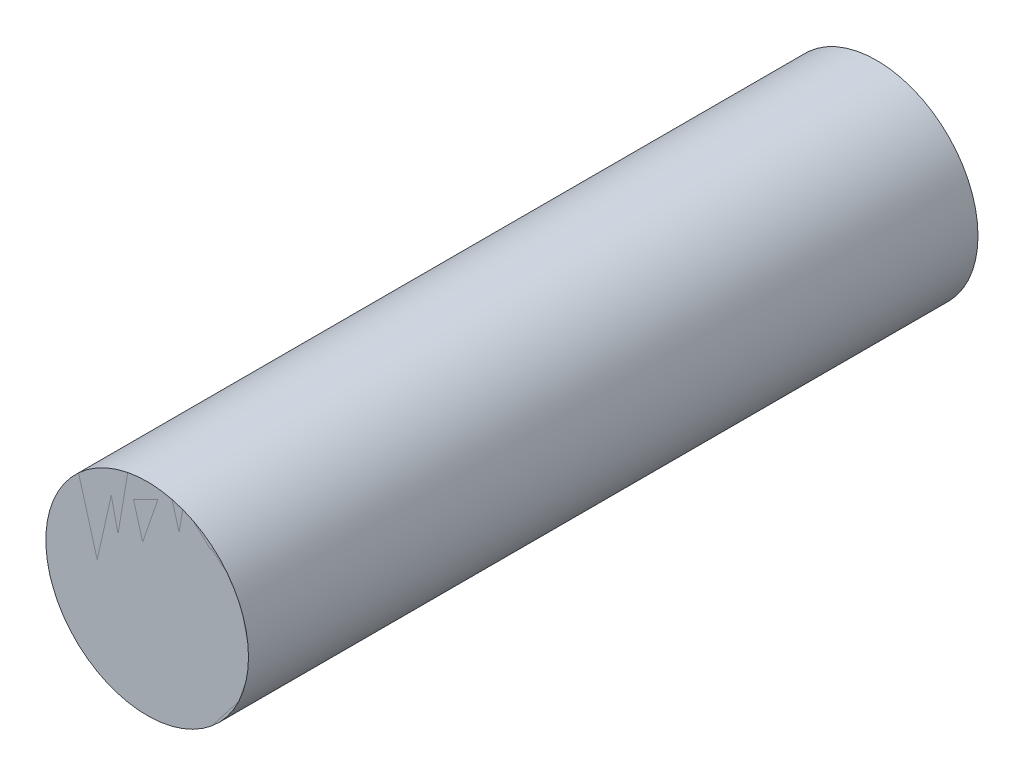
ISO-10303-21;
HEADER;
FILE_DESCRIPTION(('STEP AP214'),'2;1');
FILE_NAME('part.step','',(''),(''),'','','');
FILE_SCHEMA(('AUTOMOTIVE_DESIGN { 1 0 10303 214 1 1 1 1 }'));
ENDSEC;
DATA;
#1=APPLICATION_CONTEXT('core data for automotive mechanical design processes');
#2=APPLICATION_PROTOCOL_DEFINITION('international standard','automotive_design',2000,#1);
#3=PRODUCT_CONTEXT('',#1,'mechanical');
#4=PRODUCT('Part','Part','',(#3));
#5=PRODUCT_RELATED_PRODUCT_CATEGORY('part','',(#4));
#6=PRODUCT_DEFINITION_FORMATION('','',#4);
#7=PRODUCT_DEFINITION_CONTEXT('part definition',#1,'design');
#8=PRODUCT_DEFINITION('design','',#6,#7);
#9=PRODUCT_DEFINITION_SHAPE('','',#8);
#10=(LENGTH_UNIT() NAMED_UNIT(*) SI_UNIT(.MILLI.,.METRE.));
#11=(NAMED_UNIT(*) PLANE_ANGLE_UNIT() SI_UNIT($,.RADIAN.));
#12=(NAMED_UNIT(*) SI_UNIT($,.STERADIAN.) SOLID_ANGLE_UNIT());
#13=UNCERTAINTY_MEASURE_WITH_UNIT(LENGTH_MEASURE(1.E-05),#10,'distance_accuracy_value','');
#14=(GEOMETRIC_REPRESENTATION_CONTEXT(3) GLOBAL_UNCERTAINTY_ASSIGNED_CONTEXT((#13)) GLOBAL_UNIT_ASSIGNED_CONTEXT((#10,
#11,#12)) REPRESENTATION_CONTEXT('',''));
#15=CARTESIAN_POINT('',(0.,0.,0.));
#16=DIRECTION('',(0.,0.,1.));
#17=DIRECTION('',(1.,0.,0.));
#18=AXIS2_PLACEMENT_3D('',#15,#16,#17);
#19=CARTESIAN_POINT('',(-102.183303397109,-59.2521041199526,-7.29999999999987));
#20=DIRECTION('',(0.,0.,1.));
#21=DIRECTION('',(1.,0.,0.));
#22=AXIS2_PLACEMENT_3D('',#19,#20,#21);
#23=CYLINDRICAL_SURFACE('',#22,0.25);
#24=CARTESIAN_POINT('',(-102.183303397109,-59.2521041199526,-7.29999999999987));
#25=DIRECTION('',(0.,0.,1.));
#26=DIRECTION('',(1.,0.,0.));
#27=AXIS2_PLACEMENT_3D('',#24,#25,#26);
#28=CIRCLE('',#27,0.25);
#29=CARTESIAN_POINT('',(-101.933303397109,-59.2521041199526,-7.29999999999987));
#30=VERTEX_POINT('',#29);
#31=EDGE_CURVE('E11',#30,#30,#28,.T.);
#32=ORIENTED_EDGE('',*,*,#31,.T.);
#33=EDGE_LOOP('',(#32));
#34=FACE_BOUND('',#33,.T.);
#35=CARTESIAN_POINT('',(-102.183303397109,-59.2521041199526,-5.49999999999987));
#36=DIRECTION('',(0.,0.,1.));
#37=DIRECTION('',(1.,0.,0.));
#38=AXIS2_PLACEMENT_3D('',#35,#36,#37);
#39=CIRCLE('',#38,0.25);
#40=CARTESIAN_POINT('',(-101.933303397109,-59.2521041199526,-5.49999999999987));
#41=VERTEX_POINT('',#40);
#42=EDGE_CURVE('E46',#41,#41,#39,.T.);
#43=ORIENTED_EDGE('',*,*,#42,.F.);
#44=EDGE_LOOP('',(#43));
#45=FACE_BOUND('',#44,.T.);
#46=ADVANCED_FACE('F43',(#34,#45),#23,.T.);
#47=CARTESIAN_POINT('',(-102.183303397109,-59.2521041199526,-7.29999999999987));
#48=DIRECTION('',(0.,0.,1.));
#49=DIRECTION('',(1.,0.,0.));
#50=AXIS2_PLACEMENT_3D('',#47,#48,#49);
#51=PLANE('',#50);
#52=ORIENTED_EDGE('',*,*,#31,.F.);
#53=EDGE_LOOP('',(#52));
#54=FACE_BOUND('',#53,.T.);
#55=ADVANCED_FACE('F58',(#54),#51,.F.);
#56=CARTESIAN_POINT('',(-102.183303397109,-59.2521041199526,-5.49999999999987));
#57=DIRECTION('',(0.,0.,1.));
#58=DIRECTION('',(1.,0.,0.));
#59=AXIS2_PLACEMENT_3D('',#56,#57,#58);
#60=PLANE('',#59);
#61=ORIENTED_EDGE('',*,*,#42,.T.);
#62=EDGE_LOOP('',(#61));
#63=FACE_BOUND('',#62,.T.);
#64=ADVANCED_FACE('F55',(#63),#60,.T.);
#65=CLOSED_SHELL('',(#46,#55,#64));
#66=MANIFOLD_SOLID_BREP('B2',#65);
#67=CARTESIAN_POINT('',(-102.183303397109,-59.2521041199526,-5.49999999999986));
#68=DIRECTION('',(0.,0.,-1.));
#69=DIRECTION('',(-1.,0.,0.));
#70=AXIS2_PLACEMENT_3D('',#67,#68,#69);
#71=PLANE('',#70);
#72=CARTESIAN_POINT('',(-102.183303397109,-59.2521041199526,-5.49999999999986));
#73=DIRECTION('',(0.,0.,1.));
#74=DIRECTION('',(1.,0.,0.));
#75=AXIS2_PLACEMENT_3D('',#72,#73,#74);
#76=CIRCLE('',#75,0.25);
#77=CARTESIAN_POINT('',(-101.933303397109,-59.2521041199526,-5.49999999999986));
#78=VERTEX_POINT('',#77);
#79=EDGE_CURVE('E42',#78,#78,#76,.F.);
#80=ORIENTED_EDGE('',*,*,#79,.F.);
#81=EDGE_LOOP('',(#80));
#82=FACE_BOUND('',#81,.T.);
#83=ADVANCED_FACE('F83',(#82),#71,.F.);
#84=OPEN_SHELL('',(#83));
#85=SHELL_BASED_SURFACE_MODEL('B6',(#84));
#86=ADVANCED_BREP_SHAPE_REPRESENTATION('',(#18,#66),#14);
#87=MANIFOLD_SURFACE_SHAPE_REPRESENTATION('',(#18,#85),#14);
#88=SHAPE_REPRESENTATION('',(#18),#14);
#89=SHAPE_DEFINITION_REPRESENTATION(#9,#88);
#90=SHAPE_REPRESENTATION_RELATIONSHIP('','',#88,#86);
#91=SHAPE_REPRESENTATION_RELATIONSHIP('','',#88,#87);
ENDSEC;
END-ISO-10303-21;
